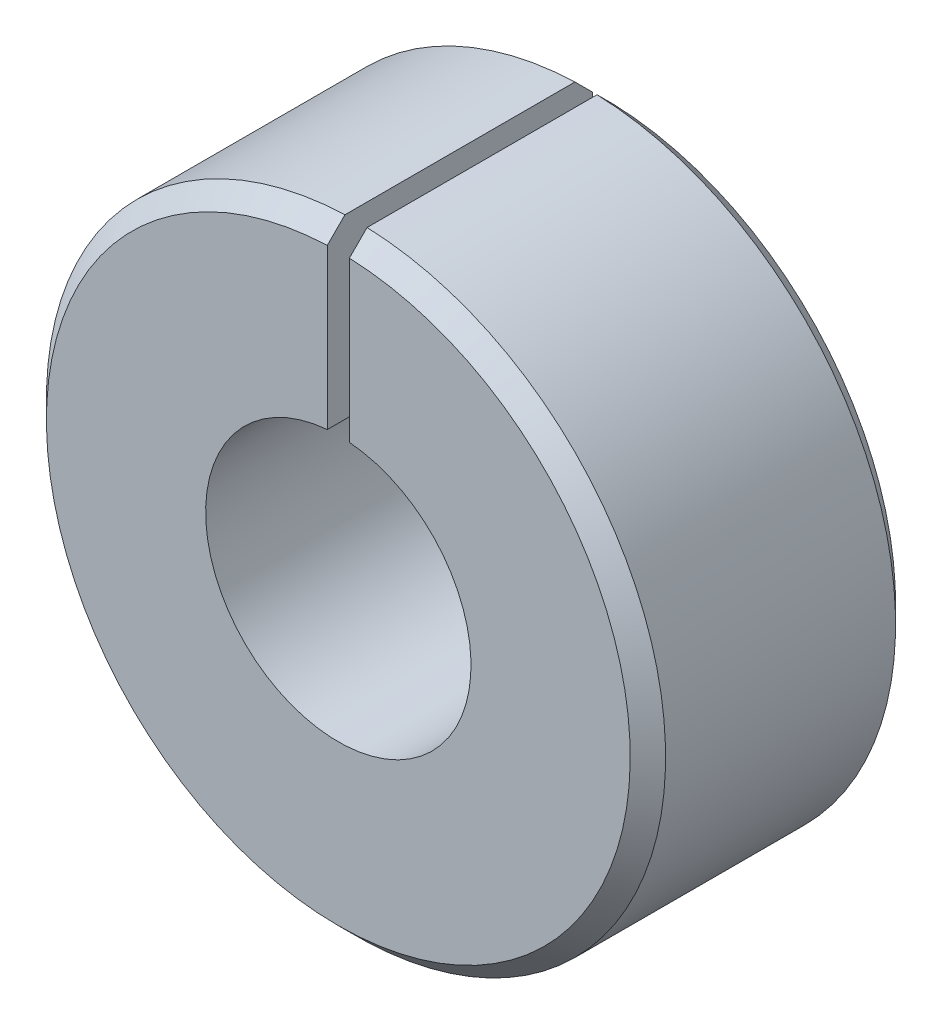
ISO-10303-21;
HEADER;
FILE_DESCRIPTION(('STEP AP214'),'2;1');
FILE_NAME('part.step','',(''),(''),'','','');
FILE_SCHEMA(('AUTOMOTIVE_DESIGN { 1 0 10303 214 1 1 1 1 }'));
ENDSEC;
DATA;
#1=APPLICATION_CONTEXT('core data for automotive mechanical design processes');
#2=APPLICATION_PROTOCOL_DEFINITION('international standard','automotive_design',2000,#1);
#3=PRODUCT_CONTEXT('',#1,'mechanical');
#4=PRODUCT('Part','Part','',(#3));
#5=PRODUCT_RELATED_PRODUCT_CATEGORY('part','',(#4));
#6=PRODUCT_DEFINITION_FORMATION('','',#4);
#7=PRODUCT_DEFINITION_CONTEXT('part definition',#1,'design');
#8=PRODUCT_DEFINITION('design','',#6,#7);
#9=PRODUCT_DEFINITION_SHAPE('','',#8);
#10=(LENGTH_UNIT() NAMED_UNIT(*) SI_UNIT(.MILLI.,.METRE.));
#11=(NAMED_UNIT(*) PLANE_ANGLE_UNIT() SI_UNIT($,.RADIAN.));
#12=(NAMED_UNIT(*) SI_UNIT($,.STERADIAN.) SOLID_ANGLE_UNIT());
#13=UNCERTAINTY_MEASURE_WITH_UNIT(LENGTH_MEASURE(1.E-05),#10,'distance_accuracy_value','');
#14=(GEOMETRIC_REPRESENTATION_CONTEXT(3) GLOBAL_UNCERTAINTY_ASSIGNED_CONTEXT((#13)) GLOBAL_UNIT_ASSIGNED_CONTEXT((#10,
#11,#12)) REPRESENTATION_CONTEXT('',''));
#15=CARTESIAN_POINT('',(0.,0.,0.));
#16=DIRECTION('',(0.,0.,1.));
#17=DIRECTION('',(1.,0.,0.));
#18=AXIS2_PLACEMENT_3D('',#15,#16,#17);
#19=CARTESIAN_POINT('',(0.,0.,4.7625));
#20=DIRECTION('',(0.,0.,-1.));
#21=DIRECTION('',(-1.,0.,0.));
#22=AXIS2_PLACEMENT_3D('',#19,#20,#21);
#23=CYLINDRICAL_SURFACE('',#22,4.7625);
#24=CARTESIAN_POINT('',(0.,0.,-4.7625));
#25=DIRECTION('',(0.,0.,-1.));
#26=DIRECTION('',(1.,0.,0.));
#27=AXIS2_PLACEMENT_3D('',#24,#25,#26);
#28=CIRCLE('',#27,4.7625);
#29=CARTESIAN_POINT('',(0.396875000000002,4.74593473241837,-4.7625));
#30=VERTEX_POINT('',#29);
#31=CARTESIAN_POINT('',(-0.396874999999996,4.74593473241837,-4.7625));
#32=VERTEX_POINT('',#31);
#33=EDGE_CURVE('E108',#30,#32,#28,.T.);
#34=ORIENTED_EDGE('',*,*,#33,.T.);
#35=DIRECTION('',(0.,0.,-1.));
#36=VECTOR('',#35,1.);
#37=CARTESIAN_POINT('',(-0.396874999999996,4.74593473241837,4.7625));
#38=LINE('',#37,#36);
#39=CARTESIAN_POINT('',(-0.396874999999996,4.74593473241837,4.7625));
#40=VERTEX_POINT('',#39);
#41=EDGE_CURVE('E92',#40,#32,#38,.T.);
#42=ORIENTED_EDGE('',*,*,#41,.F.);
#43=CARTESIAN_POINT('',(0.,0.,4.7625));
#44=DIRECTION('',(0.,0.,-1.));
#45=DIRECTION('',(1.,0.,0.));
#46=AXIS2_PLACEMENT_3D('',#43,#44,#45);
#47=CIRCLE('',#46,4.7625);
#48=CARTESIAN_POINT('',(0.396875000000002,4.74593473241837,4.7625));
#49=VERTEX_POINT('',#48);
#50=EDGE_CURVE('E97',#49,#40,#47,.T.);
#51=ORIENTED_EDGE('',*,*,#50,.F.);
#52=DIRECTION('',(0.,0.,-1.));
#53=VECTOR('',#52,1.);
#54=CARTESIAN_POINT('',(0.396875000000002,4.74593473241837,4.7625));
#55=LINE('',#54,#53);
#56=EDGE_CURVE('E224',#49,#30,#55,.T.);
#57=ORIENTED_EDGE('',*,*,#56,.T.);
#58=EDGE_LOOP('',(#34,#42,#51,#57));
#59=FACE_BOUND('',#58,.T.);
#60=ADVANCED_FACE('F34',(#59),#23,.F.);
#61=CARTESIAN_POINT('',(-0.396874999999996,4.74593473241837,4.7625));
#62=DIRECTION('',(-1.,0.,0.));
#63=DIRECTION('',(0.,-1.,0.));
#64=AXIS2_PLACEMENT_3D('',#61,#62,#63);
#65=PLANE('',#64);
#66=DIRECTION('',(0.,1.,0.));
#67=VECTOR('',#66,1.);
#68=CARTESIAN_POINT('',(-0.396874999999996,4.74593473241837,-4.7625));
#69=LINE('',#68,#67);
#70=CARTESIAN_POINT('',(-0.396874999999997,10.4699807298951,-4.7625));
#71=VERTEX_POINT('',#70);
#72=EDGE_CURVE('E216',#32,#71,#69,.T.);
#73=ORIENTED_EDGE('',*,*,#72,.T.);
#74=CARTESIAN_POINT('',(-0.396874999999997,10.4699807298951,-4.7625));
#75=CARTESIAN_POINT('',(-0.396874999999997,10.5758878307634,-4.65666877643042));
#76=CARTESIAN_POINT('',(-0.396874999999997,10.6817938774634,-4.55083649797881));
#77=CARTESIAN_POINT('',(-0.396874999999997,10.8936038625263,-4.33916983131215));
#78=CARTESIAN_POINT('',(-0.396874999999997,10.9995078008892,-4.23333544309709));
#79=CARTESIAN_POINT('',(-0.396874999999997,11.1054106850839,-4.1275));
#80=B_SPLINE_CURVE_WITH_KNOTS('',3,(#74,#75,#76,#77,#78,#79),.UNSPECIFIED.,.F.,.F.,(4,2,4),(0.,
0.449164843914785,0.898329687826948),.UNSPECIFIED.);
#81=CARTESIAN_POINT('',(-0.396874999999997,11.1054106850839,-4.1275));
#82=VERTEX_POINT('',#81);
#83=EDGE_CURVE('E43',#71,#82,#80,.T.);
#84=ORIENTED_EDGE('',*,*,#83,.T.);
#85=DIRECTION('',(0.,0.,-1.));
#86=VECTOR('',#85,1.);
#87=CARTESIAN_POINT('',(-0.396874999999997,11.1054106850839,4.7625));
#88=LINE('',#87,#86);
#89=CARTESIAN_POINT('',(-0.396874999999997,11.1054106850839,4.1275));
#90=VERTEX_POINT('',#89);
#91=EDGE_CURVE('E110',#90,#82,#88,.T.);
#92=ORIENTED_EDGE('',*,*,#91,.F.);
#93=CARTESIAN_POINT('',(-0.396874999999997,11.1054106850839,4.1275));
#94=CARTESIAN_POINT('',(-0.396874999999997,10.9995078008892,4.23333544309709));
#95=CARTESIAN_POINT('',(-0.396874999999997,10.8936038625264,4.33916983131215));
#96=CARTESIAN_POINT('',(-0.396874999999997,10.6817938774634,4.55083649797881));
#97=CARTESIAN_POINT('',(-0.396874999999997,10.5758878307634,4.65666877643042));
#98=CARTESIAN_POINT('',(-0.396874999999997,10.4699807298951,4.7625));
#99=B_SPLINE_CURVE_WITH_KNOTS('',3,(#93,#94,#95,#96,#97,#98),.UNSPECIFIED.,.F.,.F.,(4,2,4),(0.,
0.449164843912161,0.89832968782694),.UNSPECIFIED.);
#100=CARTESIAN_POINT('',(-0.396874999999997,10.4699807298951,4.7625));
#101=VERTEX_POINT('',#100);
#102=EDGE_CURVE('E50',#90,#101,#99,.T.);
#103=ORIENTED_EDGE('',*,*,#102,.T.);
#104=DIRECTION('',(0.,1.,0.));
#105=VECTOR('',#104,1.);
#106=CARTESIAN_POINT('',(-0.396874999999996,4.74593473241837,4.7625));
#107=LINE('',#106,#105);
#108=EDGE_CURVE('E88',#40,#101,#107,.T.);
#109=ORIENTED_EDGE('',*,*,#108,.F.);
#110=ORIENTED_EDGE('',*,*,#41,.T.);
#111=EDGE_LOOP('',(#73,#84,#92,#103,#109,#110));
#112=FACE_BOUND('',#111,.T.);
#113=ADVANCED_FACE('F90',(#112),#65,.F.);
#114=CARTESIAN_POINT('',(0.,0.,4.7625));
#115=DIRECTION('',(0.,0.,-1.));
#116=DIRECTION('',(-1.,0.,0.));
#117=AXIS2_PLACEMENT_3D('',#114,#115,#116);
#118=CYLINDRICAL_SURFACE('',#117,11.1125);
#119=ORIENTED_EDGE('',*,*,#91,.T.);
#120=CARTESIAN_POINT('',(0.,0.,-4.1275));
#121=DIRECTION('',(0.,0.,1.));
#122=DIRECTION('',(1.,0.,0.));
#123=AXIS2_PLACEMENT_3D('',#120,#121,#122);
#124=CIRCLE('',#123,11.1125);
#125=CARTESIAN_POINT('',(0.396875,11.1054106850839,-4.1275));
#126=VERTEX_POINT('',#125);
#127=EDGE_CURVE('E112',#82,#126,#124,.T.);
#128=ORIENTED_EDGE('',*,*,#127,.T.);
#129=DIRECTION('',(0.,0.,-1.));
#130=VECTOR('',#129,1.);
#131=CARTESIAN_POINT('',(0.396875,11.1054106850839,4.7625));
#132=LINE('',#131,#130);
#133=CARTESIAN_POINT('',(0.396875,11.1054106850839,4.1275));
#134=VERTEX_POINT('',#133);
#135=EDGE_CURVE('E115',#134,#126,#132,.T.);
#136=ORIENTED_EDGE('',*,*,#135,.F.);
#137=CARTESIAN_POINT('',(0.,0.,4.1275));
#138=DIRECTION('',(0.,0.,1.));
#139=DIRECTION('',(1.,0.,0.));
#140=AXIS2_PLACEMENT_3D('',#137,#138,#139);
#141=CIRCLE('',#140,11.1125);
#142=EDGE_CURVE('E109',#134,#90,#141,.F.);
#143=ORIENTED_EDGE('',*,*,#142,.T.);
#144=EDGE_LOOP('',(#119,#128,#136,#143));
#145=FACE_BOUND('',#144,.T.);
#146=ADVANCED_FACE('F137',(#145),#118,.T.);
#147=CARTESIAN_POINT('',(0.396875000000002,4.74593473241837,4.7625));
#148=DIRECTION('',(1.,0.,0.));
#149=DIRECTION('',(0.,1.,0.));
#150=AXIS2_PLACEMENT_3D('',#147,#148,#149);
#151=PLANE('',#150);
#152=ORIENTED_EDGE('',*,*,#135,.T.);
#153=CARTESIAN_POINT('',(0.396875,11.1054106850839,-4.1275));
#154=CARTESIAN_POINT('',(0.396875000000001,10.9995078008892,-4.23333544309709));
#155=CARTESIAN_POINT('',(0.396875000000002,10.8936038625263,-4.33916983131215));
#156=CARTESIAN_POINT('',(0.396875000000003,10.6817938774634,-4.55083649797881));
#157=CARTESIAN_POINT('',(0.396875000000003,10.5758878307634,-4.65666877643042));
#158=CARTESIAN_POINT('',(0.396875000000002,10.4699807298951,-4.7625));
#159=B_SPLINE_CURVE_WITH_KNOTS('',3,(#153,#154,#155,#156,#157,#158),.UNSPECIFIED.,.F.,.F.,(4,2,
4),(0.,0.449164843912164,0.898329687826949),.UNSPECIFIED.);
#160=CARTESIAN_POINT('',(0.396875000000002,10.4699807298951,-4.7625));
#161=VERTEX_POINT('',#160);
#162=EDGE_CURVE('E127',#126,#161,#159,.T.);
#163=ORIENTED_EDGE('',*,*,#162,.T.);
#164=DIRECTION('',(0.,-1.,0.));
#165=VECTOR('',#164,1.);
#166=CARTESIAN_POINT('',(0.396875000000002,4.74593473241837,-4.7625));
#167=LINE('',#166,#165);
#168=EDGE_CURVE('E105',#161,#30,#167,.T.);
#169=ORIENTED_EDGE('',*,*,#168,.T.);
#170=ORIENTED_EDGE('',*,*,#56,.F.);
#171=DIRECTION('',(0.,-1.,0.));
#172=VECTOR('',#171,1.);
#173=CARTESIAN_POINT('',(0.396875000000002,4.74593473241837,4.7625));
#174=LINE('',#173,#172);
#175=CARTESIAN_POINT('',(0.396875000000002,10.4699807298951,4.7625));
#176=VERTEX_POINT('',#175);
#177=EDGE_CURVE('E96',#176,#49,#174,.T.);
#178=ORIENTED_EDGE('',*,*,#177,.F.);
#179=CARTESIAN_POINT('',(0.396875000000002,10.4699807298951,4.7625));
#180=CARTESIAN_POINT('',(0.396875000000002,10.5758878307634,4.65666877643042));
#181=CARTESIAN_POINT('',(0.396875000000002,10.6817938774634,4.55083649797881));
#182=CARTESIAN_POINT('',(0.396875000000002,10.8936038625264,4.33916983131215));
#183=CARTESIAN_POINT('',(0.396875000000002,10.9995078008892,4.23333544309709));
#184=CARTESIAN_POINT('',(0.396875000000002,11.1054106850839,4.1275));
#185=B_SPLINE_CURVE_WITH_KNOTS('',3,(#179,#180,#181,#182,#183,#184),.UNSPECIFIED.,.F.,.F.,(4,2,
4),(0.,0.449164843914781,0.898329687826939),.UNSPECIFIED.);
#186=EDGE_CURVE('E121',#176,#134,#185,.T.);
#187=ORIENTED_EDGE('',*,*,#186,.T.);
#188=EDGE_LOOP('',(#152,#163,#169,#170,#178,#187));
#189=FACE_BOUND('',#188,.T.);
#190=ADVANCED_FACE('F132',(#189),#151,.F.);
#191=CARTESIAN_POINT('',(0.,0.,4.7625));
#192=DIRECTION('',(0.,0.,1.));
#193=DIRECTION('',(1.,0.,0.));
#194=AXIS2_PLACEMENT_3D('',#191,#192,#193);
#195=PLANE('',#194);
#196=ORIENTED_EDGE('',*,*,#108,.T.);
#197=CARTESIAN_POINT('',(0.,0.,4.7625));
#198=DIRECTION('',(0.,0.,1.));
#199=DIRECTION('',(1.,0.,0.));
#200=AXIS2_PLACEMENT_3D('',#197,#198,#199);
#201=CIRCLE('',#200,10.4775);
#202=EDGE_CURVE('E11',#101,#176,#201,.T.);
#203=ORIENTED_EDGE('',*,*,#202,.T.);
#204=ORIENTED_EDGE('',*,*,#177,.T.);
#205=ORIENTED_EDGE('',*,*,#50,.T.);
#206=EDGE_LOOP('',(#196,#203,#204,#205));
#207=FACE_BOUND('',#206,.T.);
#208=ADVANCED_FACE('F100',(#207),#195,.T.);
#209=CARTESIAN_POINT('',(0.,0.,-4.7625));
#210=DIRECTION('',(0.,0.,1.));
#211=DIRECTION('',(1.,0.,0.));
#212=AXIS2_PLACEMENT_3D('',#209,#210,#211);
#213=PLANE('',#212);
#214=ORIENTED_EDGE('',*,*,#168,.F.);
#215=CARTESIAN_POINT('',(0.,0.,-4.7625));
#216=DIRECTION('',(0.,0.,1.));
#217=DIRECTION('',(1.,0.,0.));
#218=AXIS2_PLACEMENT_3D('',#215,#216,#217);
#219=CIRCLE('',#218,10.4775);
#220=EDGE_CURVE('E58',#161,#71,#219,.F.);
#221=ORIENTED_EDGE('',*,*,#220,.T.);
#222=ORIENTED_EDGE('',*,*,#72,.F.);
#223=ORIENTED_EDGE('',*,*,#33,.F.);
#224=EDGE_LOOP('',(#214,#221,#222,#223));
#225=FACE_BOUND('',#224,.T.);
#226=ADVANCED_FACE('F139',(#225),#213,.F.);
#227=CARTESIAN_POINT('',(0.,0.,-4.1275));
#228=DIRECTION('',(0.,0.,1.));
#229=DIRECTION('',(1.,0.,0.));
#230=AXIS2_PLACEMENT_3D('',#227,#228,#229);
#231=CONICAL_SURFACE('',#230,11.1125,0.785398163397452);
#232=ORIENTED_EDGE('',*,*,#83,.F.);
#233=ORIENTED_EDGE('',*,*,#220,.F.);
#234=ORIENTED_EDGE('',*,*,#162,.F.);
#235=ORIENTED_EDGE('',*,*,#127,.F.);
#236=EDGE_LOOP('',(#232,#233,#234,#235));
#237=FACE_BOUND('',#236,.T.);
#238=ADVANCED_FACE('F156',(#237),#231,.T.);
#239=CARTESIAN_POINT('',(0.,0.,4.7625));
#240=DIRECTION('',(0.,0.,-1.));
#241=DIRECTION('',(-1.,0.,0.));
#242=AXIS2_PLACEMENT_3D('',#239,#240,#241);
#243=CONICAL_SURFACE('',#242,10.4775,0.785398163397448);
#244=ORIENTED_EDGE('',*,*,#102,.F.);
#245=ORIENTED_EDGE('',*,*,#142,.F.);
#246=ORIENTED_EDGE('',*,*,#186,.F.);
#247=ORIENTED_EDGE('',*,*,#202,.F.);
#248=EDGE_LOOP('',(#244,#245,#246,#247));
#249=FACE_BOUND('',#248,.T.);
#250=ADVANCED_FACE('F36',(#249),#243,.T.);
#251=CLOSED_SHELL('',(#60,#113,#146,#190,#208,#226,#238,#250));
#252=MANIFOLD_SOLID_BREP('B2',#251);
#253=ADVANCED_BREP_SHAPE_REPRESENTATION('',(#18,#252),#14);
#254=SHAPE_DEFINITION_REPRESENTATION(#9,#253);
ENDSEC;
END-ISO-10303-21;
